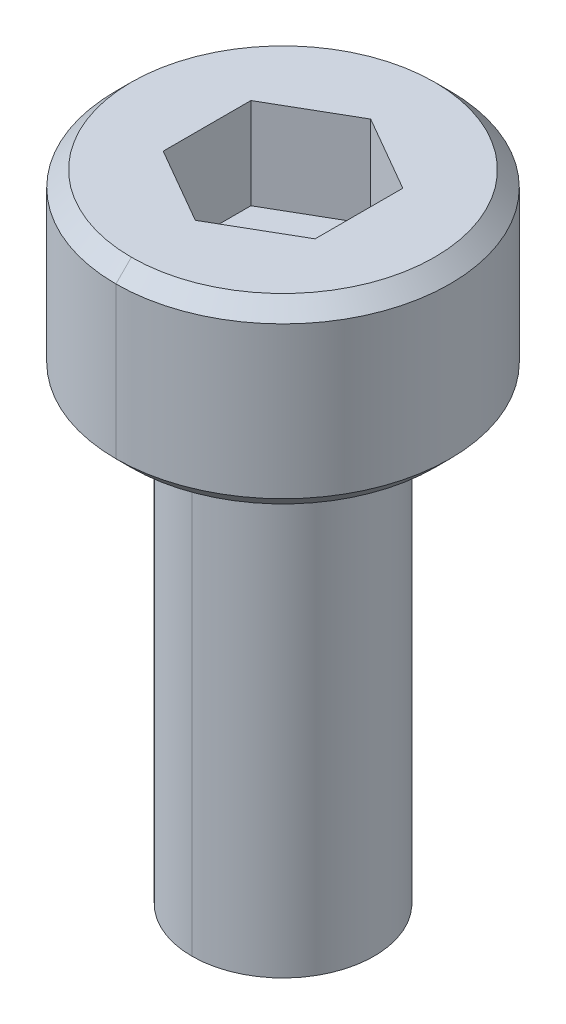
ISO-10303-21;
HEADER;
FILE_DESCRIPTION(('STEP AP214'),'2;1');
FILE_NAME('part.step','',(''),(''),'','','');
FILE_SCHEMA(('AUTOMOTIVE_DESIGN { 1 0 10303 214 1 1 1 1 }'));
ENDSEC;
DATA;
#1=APPLICATION_CONTEXT('core data for automotive mechanical design processes');
#2=APPLICATION_PROTOCOL_DEFINITION('international standard','automotive_design',2000,#1);
#3=PRODUCT_CONTEXT('',#1,'mechanical');
#4=PRODUCT('Part','Part','',(#3));
#5=PRODUCT_RELATED_PRODUCT_CATEGORY('part','',(#4));
#6=PRODUCT_DEFINITION_FORMATION('','',#4);
#7=PRODUCT_DEFINITION_CONTEXT('part definition',#1,'design');
#8=PRODUCT_DEFINITION('design','',#6,#7);
#9=PRODUCT_DEFINITION_SHAPE('','',#8);
#10=(LENGTH_UNIT() NAMED_UNIT(*) SI_UNIT(.MILLI.,.METRE.));
#11=(NAMED_UNIT(*) PLANE_ANGLE_UNIT() SI_UNIT($,.RADIAN.));
#12=(NAMED_UNIT(*) SI_UNIT($,.STERADIAN.) SOLID_ANGLE_UNIT());
#13=UNCERTAINTY_MEASURE_WITH_UNIT(LENGTH_MEASURE(1.E-05),#10,'distance_accuracy_value','');
#14=(GEOMETRIC_REPRESENTATION_CONTEXT(3) GLOBAL_UNCERTAINTY_ASSIGNED_CONTEXT((#13)) GLOBAL_UNIT_ASSIGNED_CONTEXT((#10,
#11,#12)) REPRESENTATION_CONTEXT('',''));
#15=CARTESIAN_POINT('',(0.,0.,0.));
#16=DIRECTION('',(0.,0.,1.));
#17=DIRECTION('',(1.,0.,0.));
#18=AXIS2_PLACEMENT_3D('',#15,#16,#17);
#19=CARTESIAN_POINT('',(0.,-7.46152,0.));
#20=DIRECTION('',(0.,1.,0.));
#21=DIRECTION('',(0.,0.,1.));
#22=AXIS2_PLACEMENT_3D('',#19,#20,#21);
#23=CONICAL_SURFACE('',#22,1.5,0.960291895410485);
#24=DIRECTION('',(0.,0.573280843383966,-0.819358941251616));
#25=VECTOR('',#24,1.);
#26=CARTESIAN_POINT('',(0.,-7.46152,-1.5));
#27=LINE('',#26,#25);
#28=CARTESIAN_POINT('',(0.,-8.,-0.73038));
#29=VERTEX_POINT('',#28);
#30=CARTESIAN_POINT('',(0.,-7.46152,-1.5));
#31=VERTEX_POINT('',#30);
#32=EDGE_CURVE('E206',#29,#31,#27,.T.);
#33=ORIENTED_EDGE('',*,*,#32,.F.);
#34=CARTESIAN_POINT('',(0.,-8.,0.));
#35=DIRECTION('',(0.,-1.,0.));
#36=DIRECTION('',(0.,0.,1.));
#37=AXIS2_PLACEMENT_3D('',#34,#35,#36);
#38=CIRCLE('',#37,0.73038);
#39=CARTESIAN_POINT('',(0.,-8.,0.73038));
#40=VERTEX_POINT('',#39);
#41=EDGE_CURVE('E192',#40,#29,#38,.T.);
#42=ORIENTED_EDGE('',*,*,#41,.F.);
#43=DIRECTION('',(0.,0.573280843383966,0.819358941251616));
#44=VECTOR('',#43,1.);
#45=CARTESIAN_POINT('',(0.,-7.46152,1.5));
#46=LINE('',#45,#44);
#47=CARTESIAN_POINT('',(0.,-7.46152,1.5));
#48=VERTEX_POINT('',#47);
#49=EDGE_CURVE('E227',#40,#48,#46,.T.);
#50=ORIENTED_EDGE('',*,*,#49,.T.);
#51=CARTESIAN_POINT('',(0.,-7.46152,0.));
#52=DIRECTION('',(0.,1.,0.));
#53=DIRECTION('',(0.,0.,1.));
#54=AXIS2_PLACEMENT_3D('',#51,#52,#53);
#55=CIRCLE('',#54,1.5);
#56=EDGE_CURVE('E193',#31,#48,#55,.T.);
#57=ORIENTED_EDGE('',*,*,#56,.F.);
#58=EDGE_LOOP('',(#33,#42,#50,#57));
#59=FACE_BOUND('',#58,.T.);
#60=ADVANCED_FACE('F17',(#59),#23,.T.);
#61=CARTESIAN_POINT('',(0.,0.254,0.));
#62=DIRECTION('',(0.,1.,0.));
#63=DIRECTION('',(0.,0.,1.));
#64=AXIS2_PLACEMENT_3D('',#61,#62,#63);
#65=CONICAL_SURFACE('',#64,2.75,0.78539816339745);
#66=DIRECTION('',(0.,0.707106781186546,-0.707106781186549));
#67=VECTOR('',#66,1.);
#68=CARTESIAN_POINT('',(0.,0.254,-2.75));
#69=LINE('',#68,#67);
#70=CARTESIAN_POINT('',(0.,0.,-2.496));
#71=VERTEX_POINT('',#70);
#72=CARTESIAN_POINT('',(0.,0.254,-2.75));
#73=VERTEX_POINT('',#72);
#74=EDGE_CURVE('E279',#71,#73,#69,.T.);
#75=ORIENTED_EDGE('',*,*,#74,.F.);
#76=CARTESIAN_POINT('',(0.,0.,0.));
#77=DIRECTION('',(0.,-1.,0.));
#78=DIRECTION('',(0.,0.,1.));
#79=AXIS2_PLACEMENT_3D('',#76,#77,#78);
#80=CIRCLE('',#79,2.496);
#81=CARTESIAN_POINT('',(0.,0.,2.496));
#82=VERTEX_POINT('',#81);
#83=EDGE_CURVE('E198',#82,#71,#80,.T.);
#84=ORIENTED_EDGE('',*,*,#83,.F.);
#85=DIRECTION('',(0.,0.707106781186546,0.707106781186549));
#86=VECTOR('',#85,1.);
#87=CARTESIAN_POINT('',(0.,0.254,2.75));
#88=LINE('',#87,#86);
#89=CARTESIAN_POINT('',(0.,0.254,2.75));
#90=VERTEX_POINT('',#89);
#91=EDGE_CURVE('E207',#82,#90,#88,.T.);
#92=ORIENTED_EDGE('',*,*,#91,.T.);
#93=CARTESIAN_POINT('',(0.,0.254,0.));
#94=DIRECTION('',(0.,1.,0.));
#95=DIRECTION('',(0.,0.,1.));
#96=AXIS2_PLACEMENT_3D('',#93,#94,#95);
#97=CIRCLE('',#96,2.75);
#98=EDGE_CURVE('E183',#73,#90,#97,.T.);
#99=ORIENTED_EDGE('',*,*,#98,.F.);
#100=EDGE_LOOP('',(#75,#84,#92,#99));
#101=FACE_BOUND('',#100,.T.);
#102=ADVANCED_FACE('F444',(#101),#65,.T.);
#103=CARTESIAN_POINT('',(0.,3.,0.));
#104=DIRECTION('',(0.,-1.,0.));
#105=DIRECTION('',(0.,0.,-1.));
#106=AXIS2_PLACEMENT_3D('',#103,#104,#105);
#107=CONICAL_SURFACE('',#106,2.496,0.78539816339745);
#108=DIRECTION('',(0.,-0.707106781186546,0.707106781186549));
#109=VECTOR('',#108,1.);
#110=CARTESIAN_POINT('',(0.,3.,2.496));
#111=LINE('',#110,#109);
#112=CARTESIAN_POINT('',(0.,3.,2.496));
#113=VERTEX_POINT('',#112);
#114=CARTESIAN_POINT('',(0.,2.746,2.75));
#115=VERTEX_POINT('',#114);
#116=EDGE_CURVE('E216',#113,#115,#111,.T.);
#117=ORIENTED_EDGE('',*,*,#116,.F.);
#118=CARTESIAN_POINT('',(0.,3.,0.));
#119=DIRECTION('',(0.,1.,0.));
#120=DIRECTION('',(0.,0.,1.));
#121=AXIS2_PLACEMENT_3D('',#118,#119,#120);
#122=CIRCLE('',#121,2.496);
#123=CARTESIAN_POINT('',(0.,3.,-2.496));
#124=VERTEX_POINT('',#123);
#125=EDGE_CURVE('E177',#124,#113,#122,.T.);
#126=ORIENTED_EDGE('',*,*,#125,.F.);
#127=DIRECTION('',(0.,-0.707106781186546,-0.707106781186549));
#128=VECTOR('',#127,1.);
#129=CARTESIAN_POINT('',(0.,3.,-2.496));
#130=LINE('',#129,#128);
#131=CARTESIAN_POINT('',(0.,2.746,-2.75));
#132=VERTEX_POINT('',#131);
#133=EDGE_CURVE('E255',#124,#132,#130,.T.);
#134=ORIENTED_EDGE('',*,*,#133,.T.);
#135=CARTESIAN_POINT('',(0.,2.746,0.));
#136=DIRECTION('',(0.,-1.,0.));
#137=DIRECTION('',(0.,0.,1.));
#138=AXIS2_PLACEMENT_3D('',#135,#136,#137);
#139=CIRCLE('',#138,2.75);
#140=EDGE_CURVE('E247',#115,#132,#139,.T.);
#141=ORIENTED_EDGE('',*,*,#140,.F.);
#142=EDGE_LOOP('',(#117,#126,#134,#141));
#143=FACE_BOUND('',#142,.T.);
#144=ADVANCED_FACE('F561',(#143),#107,.T.);
#145=CARTESIAN_POINT('',(-1.25,1.5,0.721687836487032));
#146=DIRECTION('',(0.,-1.,0.));
#147=DIRECTION('',(0.,0.,-1.));
#148=AXIS2_PLACEMENT_3D('',#145,#146,#147);
#149=PLANE('',#148);
#150=DIRECTION('',(0.866025403784439,0.,0.5));
#151=VECTOR('',#150,1.);
#152=CARTESIAN_POINT('',(-1.25,1.5,0.721687836487033));
#153=LINE('',#152,#151);
#154=CARTESIAN_POINT('',(-1.25,1.5,0.721687836487033));
#155=VERTEX_POINT('',#154);
#156=CARTESIAN_POINT('',(0.,1.5,1.44337567297406));
#157=VERTEX_POINT('',#156);
#158=EDGE_CURVE('E155',#155,#157,#153,.T.);
#159=ORIENTED_EDGE('',*,*,#158,.T.);
#160=DIRECTION('',(0.866025403784439,0.,-0.5));
#161=VECTOR('',#160,1.);
#162=CARTESIAN_POINT('',(0.,1.5,1.44337567297406));
#163=LINE('',#162,#161);
#164=CARTESIAN_POINT('',(1.25,1.5,0.721687836487032));
#165=VERTEX_POINT('',#164);
#166=EDGE_CURVE('E11',#157,#165,#163,.T.);
#167=ORIENTED_EDGE('',*,*,#166,.T.);
#168=DIRECTION('',(0.,0.,-1.));
#169=VECTOR('',#168,1.);
#170=CARTESIAN_POINT('',(1.25,1.5,0.721687836487032));
#171=LINE('',#170,#169);
#172=CARTESIAN_POINT('',(1.25,1.5,-0.721687836487033));
#173=VERTEX_POINT('',#172);
#174=EDGE_CURVE('E194',#165,#173,#171,.T.);
#175=ORIENTED_EDGE('',*,*,#174,.T.);
#176=DIRECTION('',(-0.866025403784439,0.,-0.5));
#177=VECTOR('',#176,1.);
#178=CARTESIAN_POINT('',(1.25,1.5,-0.721687836487033));
#179=LINE('',#178,#177);
#180=CARTESIAN_POINT('',(0.,1.5,-1.44337567297406));
#181=VERTEX_POINT('',#180);
#182=EDGE_CURVE('E239',#173,#181,#179,.T.);
#183=ORIENTED_EDGE('',*,*,#182,.T.);
#184=DIRECTION('',(-0.866025403784439,0.,0.5));
#185=VECTOR('',#184,1.);
#186=CARTESIAN_POINT('',(0.,1.5,-1.44337567297406));
#187=LINE('',#186,#185);
#188=CARTESIAN_POINT('',(-1.25,1.5,-0.721687836487032));
#189=VERTEX_POINT('',#188);
#190=EDGE_CURVE('E103',#181,#189,#187,.T.);
#191=ORIENTED_EDGE('',*,*,#190,.T.);
#192=DIRECTION('',(0.,0.,1.));
#193=VECTOR('',#192,1.);
#194=CARTESIAN_POINT('',(-1.25,1.5,-0.721687836487032));
#195=LINE('',#194,#193);
#196=EDGE_CURVE('E112',#189,#155,#195,.T.);
#197=ORIENTED_EDGE('',*,*,#196,.T.);
#198=EDGE_LOOP('',(#159,#167,#175,#183,#191,#197));
#199=FACE_BOUND('',#198,.T.);
#200=ADVANCED_FACE('F555',(#199),#149,.F.);
#201=CARTESIAN_POINT('',(0.,1.5,1.44337567297406));
#202=DIRECTION('',(0.5,0.,0.866025403784439));
#203=DIRECTION('',(0.,-1.,0.));
#204=AXIS2_PLACEMENT_3D('',#201,#202,#203);
#205=PLANE('',#204);
#206=DIRECTION('',(0.866025403784439,0.,-0.5));
#207=VECTOR('',#206,1.);
#208=CARTESIAN_POINT('',(0.,3.,1.44337567297406));
#209=LINE('',#208,#207);
#210=CARTESIAN_POINT('',(0.,3.,1.44337567297406));
#211=VERTEX_POINT('',#210);
#212=CARTESIAN_POINT('',(1.25,3.,0.721687836487032));
#213=VERTEX_POINT('',#212);
#214=EDGE_CURVE('E175',#211,#213,#209,.T.);
#215=ORIENTED_EDGE('',*,*,#214,.T.);
#216=DIRECTION('',(0.,1.,0.));
#217=VECTOR('',#216,1.);
#218=CARTESIAN_POINT('',(1.25,1.5,0.721687836487032));
#219=LINE('',#218,#217);
#220=EDGE_CURVE('E28',#165,#213,#219,.T.);
#221=ORIENTED_EDGE('',*,*,#220,.F.);
#222=ORIENTED_EDGE('',*,*,#166,.F.);
#223=DIRECTION('',(0.,1.,0.));
#224=VECTOR('',#223,1.);
#225=CARTESIAN_POINT('',(0.,1.5,1.44337567297406));
#226=LINE('',#225,#224);
#227=EDGE_CURVE('E201',#157,#211,#226,.T.);
#228=ORIENTED_EDGE('',*,*,#227,.T.);
#229=EDGE_LOOP('',(#215,#221,#222,#228));
#230=FACE_BOUND('',#229,.T.);
#231=ADVANCED_FACE('F560',(#230),#205,.F.);
#232=CARTESIAN_POINT('',(1.25,1.5,0.721687836487032));
#233=DIRECTION('',(1.,0.,0.));
#234=DIRECTION('',(0.,0.,-1.));
#235=AXIS2_PLACEMENT_3D('',#232,#233,#234);
#236=PLANE('',#235);
#237=DIRECTION('',(0.,0.,-1.));
#238=VECTOR('',#237,1.);
#239=CARTESIAN_POINT('',(1.25,3.,0.721687836487032));
#240=LINE('',#239,#238);
#241=CARTESIAN_POINT('',(1.25,3.,-0.721687836487033));
#242=VERTEX_POINT('',#241);
#243=EDGE_CURVE('E21',#213,#242,#240,.T.);
#244=ORIENTED_EDGE('',*,*,#243,.T.);
#245=DIRECTION('',(0.,1.,0.));
#246=VECTOR('',#245,1.);
#247=CARTESIAN_POINT('',(1.25,1.5,-0.721687836487033));
#248=LINE('',#247,#246);
#249=EDGE_CURVE('E197',#173,#242,#248,.T.);
#250=ORIENTED_EDGE('',*,*,#249,.F.);
#251=ORIENTED_EDGE('',*,*,#174,.F.);
#252=ORIENTED_EDGE('',*,*,#220,.T.);
#253=EDGE_LOOP('',(#244,#250,#251,#252));
#254=FACE_BOUND('',#253,.T.);
#255=ADVANCED_FACE('F19',(#254),#236,.F.);
#256=CARTESIAN_POINT('',(1.25,1.5,-0.721687836487033));
#257=DIRECTION('',(0.5,0.,-0.866025403784439));
#258=DIRECTION('',(0.,-1.,0.));
#259=AXIS2_PLACEMENT_3D('',#256,#257,#258);
#260=PLANE('',#259);
#261=DIRECTION('',(-0.866025403784439,0.,-0.5));
#262=VECTOR('',#261,1.);
#263=CARTESIAN_POINT('',(1.25,3.,-0.721687836487033));
#264=LINE('',#263,#262);
#265=CARTESIAN_POINT('',(0.,3.,-1.44337567297406));
#266=VERTEX_POINT('',#265);
#267=EDGE_CURVE('E293',#242,#266,#264,.T.);
#268=ORIENTED_EDGE('',*,*,#267,.T.);
#269=DIRECTION('',(0.,1.,0.));
#270=VECTOR('',#269,1.);
#271=CARTESIAN_POINT('',(0.,1.5,-1.44337567297406));
#272=LINE('',#271,#270);
#273=EDGE_CURVE('E235',#181,#266,#272,.T.);
#274=ORIENTED_EDGE('',*,*,#273,.F.);
#275=ORIENTED_EDGE('',*,*,#182,.F.);
#276=ORIENTED_EDGE('',*,*,#249,.T.);
#277=EDGE_LOOP('',(#268,#274,#275,#276));
#278=FACE_BOUND('',#277,.T.);
#279=ADVANCED_FACE('F290',(#278),#260,.F.);
#280=CARTESIAN_POINT('',(0.,1.5,-1.44337567297406));
#281=DIRECTION('',(-0.5,0.,-0.866025403784439));
#282=DIRECTION('',(-0.866025403784439,0.,0.5));
#283=AXIS2_PLACEMENT_3D('',#280,#281,#282);
#284=PLANE('',#283);
#285=DIRECTION('',(-0.866025403784439,0.,0.5));
#286=VECTOR('',#285,1.);
#287=CARTESIAN_POINT('',(0.,3.,-1.44337567297406));
#288=LINE('',#287,#286);
#289=CARTESIAN_POINT('',(-1.25,3.,-0.721687836487032));
#290=VERTEX_POINT('',#289);
#291=EDGE_CURVE('E168',#266,#290,#288,.T.);
#292=ORIENTED_EDGE('',*,*,#291,.T.);
#293=DIRECTION('',(0.,1.,0.));
#294=VECTOR('',#293,1.);
#295=CARTESIAN_POINT('',(-1.25,1.5,-0.721687836487032));
#296=LINE('',#295,#294);
#297=EDGE_CURVE('E163',#189,#290,#296,.T.);
#298=ORIENTED_EDGE('',*,*,#297,.F.);
#299=ORIENTED_EDGE('',*,*,#190,.F.);
#300=ORIENTED_EDGE('',*,*,#273,.T.);
#301=EDGE_LOOP('',(#292,#298,#299,#300));
#302=FACE_BOUND('',#301,.T.);
#303=ADVANCED_FACE('F537',(#302),#284,.F.);
#304=CARTESIAN_POINT('',(-1.25,1.5,-0.721687836487032));
#305=DIRECTION('',(-1.,0.,0.));
#306=DIRECTION('',(0.,0.,1.));
#307=AXIS2_PLACEMENT_3D('',#304,#305,#306);
#308=PLANE('',#307);
#309=DIRECTION('',(0.,0.,1.));
#310=VECTOR('',#309,1.);
#311=CARTESIAN_POINT('',(-1.25,3.,-0.721687836487032));
#312=LINE('',#311,#310);
#313=CARTESIAN_POINT('',(-1.25,3.,0.721687836487033));
#314=VERTEX_POINT('',#313);
#315=EDGE_CURVE('E161',#290,#314,#312,.T.);
#316=ORIENTED_EDGE('',*,*,#315,.T.);
#317=DIRECTION('',(0.,1.,0.));
#318=VECTOR('',#317,1.);
#319=CARTESIAN_POINT('',(-1.25,1.5,0.721687836487033));
#320=LINE('',#319,#318);
#321=EDGE_CURVE('E149',#155,#314,#320,.T.);
#322=ORIENTED_EDGE('',*,*,#321,.F.);
#323=ORIENTED_EDGE('',*,*,#196,.F.);
#324=ORIENTED_EDGE('',*,*,#297,.T.);
#325=EDGE_LOOP('',(#316,#322,#323,#324));
#326=FACE_BOUND('',#325,.T.);
#327=ADVANCED_FACE('F162',(#326),#308,.F.);
#328=CARTESIAN_POINT('',(-1.25,1.5,0.721687836487033));
#329=DIRECTION('',(-0.5,0.,0.866025403784439));
#330=DIRECTION('',(0.,1.,0.));
#331=AXIS2_PLACEMENT_3D('',#328,#329,#330);
#332=PLANE('',#331);
#333=DIRECTION('',(0.866025403784439,0.,0.5));
#334=VECTOR('',#333,1.);
#335=CARTESIAN_POINT('',(-1.25,3.,0.721687836487033));
#336=LINE('',#335,#334);
#337=EDGE_CURVE('E154',#314,#211,#336,.T.);
#338=ORIENTED_EDGE('',*,*,#337,.T.);
#339=ORIENTED_EDGE('',*,*,#227,.F.);
#340=ORIENTED_EDGE('',*,*,#158,.F.);
#341=ORIENTED_EDGE('',*,*,#321,.T.);
#342=EDGE_LOOP('',(#338,#339,#340,#341));
#343=FACE_BOUND('',#342,.T.);
#344=ADVANCED_FACE('F151',(#343),#332,.F.);
#345=CARTESIAN_POINT('',(0.,0.,0.));
#346=DIRECTION('',(0.,1.,0.));
#347=DIRECTION('',(1.,0.,0.));
#348=AXIS2_PLACEMENT_3D('',#345,#346,#347);
#349=PLANE('',#348);
#350=CARTESIAN_POINT('',(0.,0.,0.));
#351=DIRECTION('',(0.,1.,0.));
#352=DIRECTION('',(0.,0.,1.));
#353=AXIS2_PLACEMENT_3D('',#350,#351,#352);
#354=CIRCLE('',#353,1.5);
#355=CARTESIAN_POINT('',(0.,0.,1.5));
#356=VERTEX_POINT('',#355);
#357=CARTESIAN_POINT('',(0.,0.,-1.5));
#358=VERTEX_POINT('',#357);
#359=EDGE_CURVE('E221',#356,#358,#354,.T.);
#360=ORIENTED_EDGE('',*,*,#359,.T.);
#361=CARTESIAN_POINT('',(0.,0.,0.));
#362=DIRECTION('',(0.,1.,0.));
#363=DIRECTION('',(0.,0.,1.));
#364=AXIS2_PLACEMENT_3D('',#361,#362,#363);
#365=CIRCLE('',#364,1.5);
#366=EDGE_CURVE('E189',#358,#356,#365,.T.);
#367=ORIENTED_EDGE('',*,*,#366,.T.);
#368=EDGE_LOOP('',(#360,#367));
#369=FACE_BOUND('',#368,.T.);
#370=ORIENTED_EDGE('',*,*,#83,.T.);
#371=CARTESIAN_POINT('',(0.,0.,0.));
#372=DIRECTION('',(0.,-1.,0.));
#373=DIRECTION('',(0.,0.,1.));
#374=AXIS2_PLACEMENT_3D('',#371,#372,#373);
#375=CIRCLE('',#374,2.496);
#376=EDGE_CURVE('E231',#71,#82,#375,.T.);
#377=ORIENTED_EDGE('',*,*,#376,.T.);
#378=EDGE_LOOP('',(#370,#377));
#379=FACE_BOUND('',#378,.T.);
#380=ADVANCED_FACE('F452',(#369,#379),#349,.F.);
#381=CARTESIAN_POINT('',(0.,3.,0.));
#382=DIRECTION('',(0.,1.,0.));
#383=DIRECTION('',(1.,0.,0.));
#384=AXIS2_PLACEMENT_3D('',#381,#382,#383);
#385=PLANE('',#384);
#386=ORIENTED_EDGE('',*,*,#337,.F.);
#387=ORIENTED_EDGE('',*,*,#315,.F.);
#388=ORIENTED_EDGE('',*,*,#291,.F.);
#389=ORIENTED_EDGE('',*,*,#267,.F.);
#390=ORIENTED_EDGE('',*,*,#243,.F.);
#391=ORIENTED_EDGE('',*,*,#214,.F.);
#392=EDGE_LOOP('',(#386,#387,#388,#389,#390,#391));
#393=FACE_BOUND('',#392,.T.);
#394=ORIENTED_EDGE('',*,*,#125,.T.);
#395=CARTESIAN_POINT('',(0.,3.,0.));
#396=DIRECTION('',(0.,1.,0.));
#397=DIRECTION('',(0.,0.,1.));
#398=AXIS2_PLACEMENT_3D('',#395,#396,#397);
#399=CIRCLE('',#398,2.496);
#400=EDGE_CURVE('E187',#113,#124,#399,.T.);
#401=ORIENTED_EDGE('',*,*,#400,.T.);
#402=EDGE_LOOP('',(#394,#401));
#403=FACE_BOUND('',#402,.T.);
#404=ADVANCED_FACE('F171',(#393,#403),#385,.T.);
#405=CARTESIAN_POINT('',(0.,3.,0.));
#406=DIRECTION('',(0.,-1.,0.));
#407=DIRECTION('',(0.,0.,-1.));
#408=AXIS2_PLACEMENT_3D('',#405,#406,#407);
#409=CYLINDRICAL_SURFACE('',#408,2.75);
#410=DIRECTION('',(0.,-1.,0.));
#411=VECTOR('',#410,1.);
#412=CARTESIAN_POINT('',(0.,3.,2.75));
#413=LINE('',#412,#411);
#414=EDGE_CURVE('E244',#115,#90,#413,.T.);
#415=ORIENTED_EDGE('',*,*,#414,.F.);
#416=ORIENTED_EDGE('',*,*,#140,.T.);
#417=DIRECTION('',(0.,-1.,0.));
#418=VECTOR('',#417,1.);
#419=CARTESIAN_POINT('',(0.,3.,-2.75));
#420=LINE('',#419,#418);
#421=EDGE_CURVE('E240',#132,#73,#420,.T.);
#422=ORIENTED_EDGE('',*,*,#421,.T.);
#423=ORIENTED_EDGE('',*,*,#98,.T.);
#424=EDGE_LOOP('',(#415,#416,#422,#423));
#425=FACE_BOUND('',#424,.T.);
#426=ADVANCED_FACE('F485',(#425),#409,.T.);
#427=CARTESIAN_POINT('',(0.,-8.,0.));
#428=DIRECTION('',(0.,1.,0.));
#429=DIRECTION('',(1.,0.,0.));
#430=AXIS2_PLACEMENT_3D('',#427,#428,#429);
#431=PLANE('',#430);
#432=ORIENTED_EDGE('',*,*,#41,.T.);
#433=CARTESIAN_POINT('',(0.,-8.,0.));
#434=DIRECTION('',(0.,-1.,0.));
#435=DIRECTION('',(0.,0.,1.));
#436=AXIS2_PLACEMENT_3D('',#433,#434,#435);
#437=CIRCLE('',#436,0.73038);
#438=EDGE_CURVE('E202',#29,#40,#437,.T.);
#439=ORIENTED_EDGE('',*,*,#438,.T.);
#440=EDGE_LOOP('',(#432,#439));
#441=FACE_BOUND('',#440,.T.);
#442=ADVANCED_FACE('F480',(#441),#431,.F.);
#443=CARTESIAN_POINT('',(0.,-8.,0.));
#444=DIRECTION('',(0.,1.,0.));
#445=DIRECTION('',(0.,0.,1.));
#446=AXIS2_PLACEMENT_3D('',#443,#444,#445);
#447=CYLINDRICAL_SURFACE('',#446,1.5);
#448=DIRECTION('',(0.,1.,0.));
#449=VECTOR('',#448,1.);
#450=CARTESIAN_POINT('',(0.,-8.,-1.5));
#451=LINE('',#450,#449);
#452=EDGE_CURVE('E226',#31,#358,#451,.T.);
#453=ORIENTED_EDGE('',*,*,#452,.F.);
#454=ORIENTED_EDGE('',*,*,#56,.T.);
#455=DIRECTION('',(0.,1.,0.));
#456=VECTOR('',#455,1.);
#457=CARTESIAN_POINT('',(0.,-8.,1.5));
#458=LINE('',#457,#456);
#459=EDGE_CURVE('E225',#48,#356,#458,.T.);
#460=ORIENTED_EDGE('',*,*,#459,.T.);
#461=ORIENTED_EDGE('',*,*,#366,.F.);
#462=EDGE_LOOP('',(#453,#454,#460,#461));
#463=FACE_BOUND('',#462,.T.);
#464=ADVANCED_FACE('F471',(#463),#447,.T.);
#465=CARTESIAN_POINT('',(0.,-8.,0.));
#466=DIRECTION('',(0.,1.,0.));
#467=DIRECTION('',(0.,0.,1.));
#468=AXIS2_PLACEMENT_3D('',#465,#466,#467);
#469=CYLINDRICAL_SURFACE('',#468,1.5);
#470=CARTESIAN_POINT('',(0.,-7.46152,0.));
#471=DIRECTION('',(0.,1.,0.));
#472=DIRECTION('',(0.,0.,1.));
#473=AXIS2_PLACEMENT_3D('',#470,#471,#472);
#474=CIRCLE('',#473,1.5);
#475=EDGE_CURVE('E232',#48,#31,#474,.T.);
#476=ORIENTED_EDGE('',*,*,#475,.T.);
#477=ORIENTED_EDGE('',*,*,#452,.T.);
#478=ORIENTED_EDGE('',*,*,#359,.F.);
#479=ORIENTED_EDGE('',*,*,#459,.F.);
#480=EDGE_LOOP('',(#476,#477,#478,#479));
#481=FACE_BOUND('',#480,.T.);
#482=ADVANCED_FACE('F465',(#481),#469,.T.);
#483=CARTESIAN_POINT('',(0.,3.,0.));
#484=DIRECTION('',(0.,-1.,0.));
#485=DIRECTION('',(0.,0.,-1.));
#486=AXIS2_PLACEMENT_3D('',#483,#484,#485);
#487=CYLINDRICAL_SURFACE('',#486,2.75);
#488=CARTESIAN_POINT('',(0.,2.746,0.));
#489=DIRECTION('',(0.,-1.,0.));
#490=DIRECTION('',(0.,0.,1.));
#491=AXIS2_PLACEMENT_3D('',#488,#489,#490);
#492=CIRCLE('',#491,2.75);
#493=EDGE_CURVE('E220',#132,#115,#492,.T.);
#494=ORIENTED_EDGE('',*,*,#493,.T.);
#495=ORIENTED_EDGE('',*,*,#414,.T.);
#496=CARTESIAN_POINT('',(0.,0.254,0.));
#497=DIRECTION('',(0.,1.,0.));
#498=DIRECTION('',(0.,0.,1.));
#499=AXIS2_PLACEMENT_3D('',#496,#497,#498);
#500=CIRCLE('',#499,2.75);
#501=EDGE_CURVE('E211',#90,#73,#500,.T.);
#502=ORIENTED_EDGE('',*,*,#501,.T.);
#503=ORIENTED_EDGE('',*,*,#421,.F.);
#504=EDGE_LOOP('',(#494,#495,#502,#503));
#505=FACE_BOUND('',#504,.T.);
#506=ADVANCED_FACE('F470',(#505),#487,.T.);
#507=CARTESIAN_POINT('',(0.,3.,0.));
#508=DIRECTION('',(0.,-1.,0.));
#509=DIRECTION('',(0.,0.,-1.));
#510=AXIS2_PLACEMENT_3D('',#507,#508,#509);
#511=CONICAL_SURFACE('',#510,2.496,0.78539816339745);
#512=ORIENTED_EDGE('',*,*,#400,.F.);
#513=ORIENTED_EDGE('',*,*,#116,.T.);
#514=ORIENTED_EDGE('',*,*,#493,.F.);
#515=ORIENTED_EDGE('',*,*,#133,.F.);
#516=EDGE_LOOP('',(#512,#513,#514,#515));
#517=FACE_BOUND('',#516,.T.);
#518=ADVANCED_FACE('F520',(#517),#511,.T.);
#519=CARTESIAN_POINT('',(0.,0.254,0.));
#520=DIRECTION('',(0.,1.,0.));
#521=DIRECTION('',(0.,0.,1.));
#522=AXIS2_PLACEMENT_3D('',#519,#520,#521);
#523=CONICAL_SURFACE('',#522,2.75,0.78539816339745);
#524=ORIENTED_EDGE('',*,*,#376,.F.);
#525=ORIENTED_EDGE('',*,*,#74,.T.);
#526=ORIENTED_EDGE('',*,*,#501,.F.);
#527=ORIENTED_EDGE('',*,*,#91,.F.);
#528=EDGE_LOOP('',(#524,#525,#526,#527));
#529=FACE_BOUND('',#528,.T.);
#530=ADVANCED_FACE('F525',(#529),#523,.T.);
#531=CARTESIAN_POINT('',(0.,-7.46152,0.));
#532=DIRECTION('',(0.,1.,0.));
#533=DIRECTION('',(0.,0.,1.));
#534=AXIS2_PLACEMENT_3D('',#531,#532,#533);
#535=CONICAL_SURFACE('',#534,1.5,0.960291895410485);
#536=ORIENTED_EDGE('',*,*,#438,.F.);
#537=ORIENTED_EDGE('',*,*,#32,.T.);
#538=ORIENTED_EDGE('',*,*,#475,.F.);
#539=ORIENTED_EDGE('',*,*,#49,.F.);
#540=EDGE_LOOP('',(#536,#537,#538,#539));
#541=FACE_BOUND('',#540,.T.);
#542=ADVANCED_FACE('F545',(#541),#535,.T.);
#543=CLOSED_SHELL('',(#60,#102,#144,#200,#231,#255,#279,#303,#327,#344,#380,#404,#426,#442,#464,
#482,#506,#518,#530,#542));
#544=MANIFOLD_SOLID_BREP('B1',#543);
#545=ADVANCED_BREP_SHAPE_REPRESENTATION('',(#18,#544),#14);
#546=SHAPE_DEFINITION_REPRESENTATION(#9,#545);
ENDSEC;
END-ISO-10303-21;
